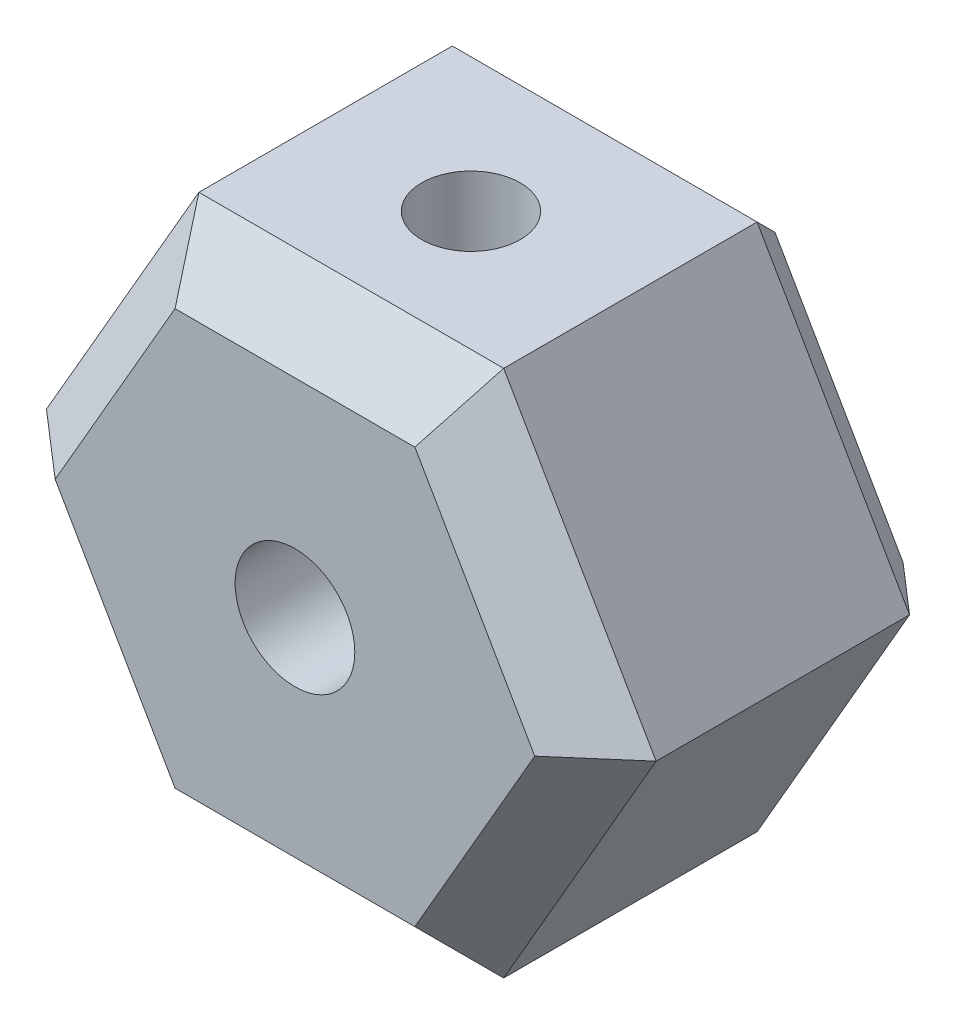
ISO-10303-21;
HEADER;
FILE_DESCRIPTION(('STEP AP214'),'2;1');
FILE_NAME('part.step','',(''),(''),'','','');
FILE_SCHEMA(('AUTOMOTIVE_DESIGN { 1 0 10303 214 1 1 1 1 }'));
ENDSEC;
DATA;
#1=APPLICATION_CONTEXT('core data for automotive mechanical design processes');
#2=APPLICATION_PROTOCOL_DEFINITION('international standard','automotive_design',2000,#1);
#3=PRODUCT_CONTEXT('',#1,'mechanical');
#4=PRODUCT('Part','Part','',(#3));
#5=PRODUCT_RELATED_PRODUCT_CATEGORY('part','',(#4));
#6=PRODUCT_DEFINITION_FORMATION('','',#4);
#7=PRODUCT_DEFINITION_CONTEXT('part definition',#1,'design');
#8=PRODUCT_DEFINITION('design','',#6,#7);
#9=PRODUCT_DEFINITION_SHAPE('','',#8);
#10=(LENGTH_UNIT() NAMED_UNIT(*) SI_UNIT(.MILLI.,.METRE.));
#11=(NAMED_UNIT(*) PLANE_ANGLE_UNIT() SI_UNIT($,.RADIAN.));
#12=(NAMED_UNIT(*) SI_UNIT($,.STERADIAN.) SOLID_ANGLE_UNIT());
#13=UNCERTAINTY_MEASURE_WITH_UNIT(LENGTH_MEASURE(1.E-05),#10,'distance_accuracy_value','');
#14=(GEOMETRIC_REPRESENTATION_CONTEXT(3) GLOBAL_UNCERTAINTY_ASSIGNED_CONTEXT((#13)) GLOBAL_UNIT_ASSIGNED_CONTEXT((#10,
#11,#12)) REPRESENTATION_CONTEXT('',''));
#15=CARTESIAN_POINT('',(0.,0.,0.));
#16=DIRECTION('',(0.,0.,1.));
#17=DIRECTION('',(1.,0.,0.));
#18=AXIS2_PLACEMENT_3D('',#15,#16,#17);
#19=CARTESIAN_POINT('',(0.,0.,10.));
#20=DIRECTION('',(0.,0.,1.));
#21=DIRECTION('',(1.,0.,0.));
#22=AXIS2_PLACEMENT_3D('',#19,#20,#21);
#23=PLANE('',#22);
#24=DIRECTION('',(-0.5,-0.866025403784439,0.));
#25=VECTOR('',#24,1.);
#26=CARTESIAN_POINT('',(-7.27461339178929,-0.8,10.));
#27=LINE('',#26,#25);
#28=CARTESIAN_POINT('',(-3.40636658821879,5.90000000000001,10.));
#29=VERTEX_POINT('',#28);
#30=CARTESIAN_POINT('',(-6.81273317643759,0.,10.));
#31=VERTEX_POINT('',#30);
#32=EDGE_CURVE('E138',#29,#31,#27,.T.);
#33=ORIENTED_EDGE('',*,*,#32,.T.);
#34=DIRECTION('',(0.5,-0.866025403784439,0.));
#35=VECTOR('',#34,1.);
#36=CARTESIAN_POINT('',(-2.94448637286709,-6.7,10.));
#37=LINE('',#36,#35);
#38=CARTESIAN_POINT('',(-3.40636658821879,-5.90000000000001,10.));
#39=VERTEX_POINT('',#38);
#40=EDGE_CURVE('E185',#31,#39,#37,.T.);
#41=ORIENTED_EDGE('',*,*,#40,.T.);
#42=DIRECTION('',(1.,0.,0.));
#43=VECTOR('',#42,1.);
#44=CARTESIAN_POINT('',(4.33012701892219,-5.90000000000001,10.));
#45=LINE('',#44,#43);
#46=CARTESIAN_POINT('',(3.40636658821879,-5.90000000000001,10.));
#47=VERTEX_POINT('',#46);
#48=EDGE_CURVE('E182',#39,#47,#45,.T.);
#49=ORIENTED_EDGE('',*,*,#48,.T.);
#50=DIRECTION('',(0.5,0.866025403784439,0.));
#51=VECTOR('',#50,1.);
#52=CARTESIAN_POINT('',(7.27461339178929,0.800000000000001,10.));
#53=LINE('',#52,#51);
#54=CARTESIAN_POINT('',(6.81273317643758,0.,10.));
#55=VERTEX_POINT('',#54);
#56=EDGE_CURVE('E179',#47,#55,#53,.T.);
#57=ORIENTED_EDGE('',*,*,#56,.T.);
#58=DIRECTION('',(-0.5,0.866025403784439,0.));
#59=VECTOR('',#58,1.);
#60=CARTESIAN_POINT('',(2.94448637286709,6.70000000000001,10.));
#61=LINE('',#60,#59);
#62=CARTESIAN_POINT('',(3.40636658821879,5.90000000000001,10.));
#63=VERTEX_POINT('',#62);
#64=EDGE_CURVE('E141',#55,#63,#61,.T.);
#65=ORIENTED_EDGE('',*,*,#64,.T.);
#66=DIRECTION('',(-1.,0.,0.));
#67=VECTOR('',#66,1.);
#68=CARTESIAN_POINT('',(-4.33012701892219,5.90000000000001,10.));
#69=LINE('',#68,#67);
#70=EDGE_CURVE('E133',#63,#29,#69,.T.);
#71=ORIENTED_EDGE('',*,*,#70,.T.);
#72=EDGE_LOOP('',(#33,#41,#49,#57,#65,#71));
#73=FACE_BOUND('',#72,.T.);
#74=CARTESIAN_POINT('',(0.,0.,10.));
#75=DIRECTION('',(0.,0.,1.));
#76=DIRECTION('',(1.,0.,0.));
#77=AXIS2_PLACEMENT_3D('',#74,#75,#76);
#78=CIRCLE('',#77,1.7);
#79=CARTESIAN_POINT('',(1.7,0.,10.));
#80=VERTEX_POINT('',#79);
#81=EDGE_CURVE('E576',#80,#80,#78,.T.);
#82=ORIENTED_EDGE('',*,*,#81,.F.);
#83=EDGE_LOOP('',(#82));
#84=FACE_BOUND('',#83,.T.);
#85=ADVANCED_FACE('F41',(#73,#84),#23,.T.);
#86=CARTESIAN_POINT('',(0.,0.,0.));
#87=DIRECTION('',(0.,0.,1.));
#88=DIRECTION('',(1.,0.,0.));
#89=AXIS2_PLACEMENT_3D('',#86,#87,#88);
#90=PLANE('',#89);
#91=DIRECTION('',(0.5,0.866025403784439,0.));
#92=VECTOR('',#91,1.);
#93=CARTESIAN_POINT('',(-5.45596004384196,3.15,0.));
#94=LINE('',#93,#92);
#95=CARTESIAN_POINT('',(-7.27461339178929,0.,0.));
#96=VERTEX_POINT('',#95);
#97=CARTESIAN_POINT('',(-3.63730669589464,6.3,0.));
#98=VERTEX_POINT('',#97);
#99=EDGE_CURVE('E225',#96,#98,#94,.T.);
#100=ORIENTED_EDGE('',*,*,#99,.T.);
#101=DIRECTION('',(1.,0.,0.));
#102=VECTOR('',#101,1.);
#103=CARTESIAN_POINT('',(0.,6.3,0.));
#104=LINE('',#103,#102);
#105=CARTESIAN_POINT('',(3.63730669589464,6.3,0.));
#106=VERTEX_POINT('',#105);
#107=EDGE_CURVE('E240',#98,#106,#104,.T.);
#108=ORIENTED_EDGE('',*,*,#107,.T.);
#109=DIRECTION('',(0.5,-0.866025403784439,0.));
#110=VECTOR('',#109,1.);
#111=CARTESIAN_POINT('',(5.45596004384196,3.15,0.));
#112=LINE('',#111,#110);
#113=CARTESIAN_POINT('',(7.27461339178928,0.,0.));
#114=VERTEX_POINT('',#113);
#115=EDGE_CURVE('E237',#106,#114,#112,.T.);
#116=ORIENTED_EDGE('',*,*,#115,.T.);
#117=DIRECTION('',(-0.5,-0.866025403784439,0.));
#118=VECTOR('',#117,1.);
#119=CARTESIAN_POINT('',(5.45596004384196,-3.15,0.));
#120=LINE('',#119,#118);
#121=CARTESIAN_POINT('',(3.63730669589464,-6.3,0.));
#122=VERTEX_POINT('',#121);
#123=EDGE_CURVE('E234',#114,#122,#120,.T.);
#124=ORIENTED_EDGE('',*,*,#123,.T.);
#125=DIRECTION('',(-1.,0.,0.));
#126=VECTOR('',#125,1.);
#127=CARTESIAN_POINT('',(0.,-6.3,0.));
#128=LINE('',#127,#126);
#129=CARTESIAN_POINT('',(-3.63730669589464,-6.3,0.));
#130=VERTEX_POINT('',#129);
#131=EDGE_CURVE('E231',#122,#130,#128,.T.);
#132=ORIENTED_EDGE('',*,*,#131,.T.);
#133=DIRECTION('',(-0.5,0.866025403784439,0.));
#134=VECTOR('',#133,1.);
#135=CARTESIAN_POINT('',(-5.45596004384197,-3.15,0.));
#136=LINE('',#135,#134);
#137=EDGE_CURVE('E228',#130,#96,#136,.T.);
#138=ORIENTED_EDGE('',*,*,#137,.T.);
#139=EDGE_LOOP('',(#100,#108,#116,#124,#132,#138));
#140=FACE_BOUND('',#139,.T.);
#141=CARTESIAN_POINT('',(0.,0.,0.));
#142=DIRECTION('',(0.,0.,1.));
#143=DIRECTION('',(1.,0.,0.));
#144=AXIS2_PLACEMENT_3D('',#141,#142,#143);
#145=CIRCLE('',#144,1.7);
#146=CARTESIAN_POINT('',(1.7,0.,0.));
#147=VERTEX_POINT('',#146);
#148=EDGE_CURVE('E582',#147,#147,#145,.T.);
#149=ORIENTED_EDGE('',*,*,#148,.T.);
#150=EDGE_LOOP('',(#149));
#151=FACE_BOUND('',#150,.T.);
#152=ADVANCED_FACE('F286',(#140,#151),#90,.F.);
#153=CARTESIAN_POINT('',(4.33012701892219,-7.5,10.));
#154=DIRECTION('',(-0.866025403784439,0.5,0.));
#155=DIRECTION('',(-0.5,-0.866025403784439,0.));
#156=AXIS2_PLACEMENT_3D('',#153,#154,#155);
#157=PLANE('',#156);
#158=DIRECTION('',(0.,0.,-1.));
#159=VECTOR('',#158,1.);
#160=CARTESIAN_POINT('',(4.33012701892219,-7.5,10.));
#161=LINE('',#160,#159);
#162=CARTESIAN_POINT('',(4.33012701892219,-7.5,8.4));
#163=VERTEX_POINT('',#162);
#164=CARTESIAN_POINT('',(4.33012701892219,-7.5,1.19999999999999));
#165=VERTEX_POINT('',#164);
#166=EDGE_CURVE('E572',#163,#165,#161,.T.);
#167=ORIENTED_EDGE('',*,*,#166,.T.);
#168=DIRECTION('',(0.5,0.866025403784439,0.));
#169=VECTOR('',#168,1.);
#170=CARTESIAN_POINT('',(4.33012701892219,-7.5,1.19999999999999));
#171=LINE('',#170,#169);
#172=CARTESIAN_POINT('',(8.66025403784438,0.,1.19999999999999));
#173=VERTEX_POINT('',#172);
#174=EDGE_CURVE('E247',#165,#173,#171,.T.);
#175=ORIENTED_EDGE('',*,*,#174,.T.);
#176=DIRECTION('',(0.,0.,-1.));
#177=VECTOR('',#176,1.);
#178=CARTESIAN_POINT('',(8.66025403784438,0.,10.));
#179=LINE('',#178,#177);
#180=CARTESIAN_POINT('',(8.66025403784438,0.,8.4));
#181=VERTEX_POINT('',#180);
#182=EDGE_CURVE('E162',#181,#173,#179,.T.);
#183=ORIENTED_EDGE('',*,*,#182,.F.);
#184=DIRECTION('',(-0.5,-0.866025403784439,0.));
#185=VECTOR('',#184,1.);
#186=CARTESIAN_POINT('',(4.33012701892219,-7.5,8.4));
#187=LINE('',#186,#185);
#188=EDGE_CURVE('E195',#181,#163,#187,.T.);
#189=ORIENTED_EDGE('',*,*,#188,.T.);
#190=EDGE_LOOP('',(#167,#175,#183,#189));
#191=FACE_BOUND('',#190,.T.);
#192=ADVANCED_FACE('F341',(#191),#157,.F.);
#193=CARTESIAN_POINT('',(8.66025403784438,0.,10.));
#194=DIRECTION('',(-0.866025403784439,-0.5,0.));
#195=DIRECTION('',(0.5,-0.866025403784439,0.));
#196=AXIS2_PLACEMENT_3D('',#193,#194,#195);
#197=PLANE('',#196);
#198=ORIENTED_EDGE('',*,*,#182,.T.);
#199=DIRECTION('',(-0.5,0.866025403784439,0.));
#200=VECTOR('',#199,1.);
#201=CARTESIAN_POINT('',(8.66025403784438,0.,1.19999999999999));
#202=LINE('',#201,#200);
#203=CARTESIAN_POINT('',(4.33012701892219,7.5,1.19999999999999));
#204=VERTEX_POINT('',#203);
#205=EDGE_CURVE('E244',#173,#204,#202,.T.);
#206=ORIENTED_EDGE('',*,*,#205,.T.);
#207=DIRECTION('',(0.,0.,-1.));
#208=VECTOR('',#207,1.);
#209=CARTESIAN_POINT('',(4.33012701892219,7.5,10.));
#210=LINE('',#209,#208);
#211=CARTESIAN_POINT('',(4.33012701892219,7.5,8.4));
#212=VERTEX_POINT('',#211);
#213=EDGE_CURVE('E166',#212,#204,#210,.T.);
#214=ORIENTED_EDGE('',*,*,#213,.F.);
#215=DIRECTION('',(0.5,-0.866025403784439,0.));
#216=VECTOR('',#215,1.);
#217=CARTESIAN_POINT('',(8.66025403784438,0.,8.4));
#218=LINE('',#217,#216);
#219=EDGE_CURVE('E198',#212,#181,#218,.T.);
#220=ORIENTED_EDGE('',*,*,#219,.T.);
#221=EDGE_LOOP('',(#198,#206,#214,#220));
#222=FACE_BOUND('',#221,.T.);
#223=ADVANCED_FACE('F299',(#222),#197,.F.);
#224=CARTESIAN_POINT('',(4.33012701892219,7.5,10.));
#225=DIRECTION('',(0.,-1.,0.));
#226=DIRECTION('',(0.,0.,-1.));
#227=AXIS2_PLACEMENT_3D('',#224,#225,#226);
#228=PLANE('',#227);
#229=CARTESIAN_POINT('',(0.,7.50000000000001,5.));
#230=DIRECTION('',(0.,-1.,0.));
#231=DIRECTION('',(0.,0.,-1.));
#232=AXIS2_PLACEMENT_3D('',#229,#230,#231);
#233=CIRCLE('',#232,1.4);
#234=CARTESIAN_POINT('',(0.,7.50000000000001,3.6));
#235=VERTEX_POINT('',#234);
#236=EDGE_CURVE('E318',#235,#235,#233,.T.);
#237=ORIENTED_EDGE('',*,*,#236,.T.);
#238=EDGE_LOOP('',(#237));
#239=FACE_BOUND('',#238,.T.);
#240=ORIENTED_EDGE('',*,*,#213,.T.);
#241=DIRECTION('',(-1.,0.,0.));
#242=VECTOR('',#241,1.);
#243=CARTESIAN_POINT('',(4.33012701892219,7.5,1.19999999999999));
#244=LINE('',#243,#242);
#245=CARTESIAN_POINT('',(-4.33012701892219,7.5,1.19999999999999));
#246=VERTEX_POINT('',#245);
#247=EDGE_CURVE('E206',#204,#246,#244,.T.);
#248=ORIENTED_EDGE('',*,*,#247,.T.);
#249=DIRECTION('',(0.,0.,-1.));
#250=VECTOR('',#249,1.);
#251=CARTESIAN_POINT('',(-4.33012701892219,7.5,10.));
#252=LINE('',#251,#250);
#253=CARTESIAN_POINT('',(-4.33012701892219,7.5,8.4));
#254=VERTEX_POINT('',#253);
#255=EDGE_CURVE('E306',#254,#246,#252,.T.);
#256=ORIENTED_EDGE('',*,*,#255,.F.);
#257=DIRECTION('',(1.,0.,0.));
#258=VECTOR('',#257,1.);
#259=CARTESIAN_POINT('',(4.33012701892219,7.5,8.4));
#260=LINE('',#259,#258);
#261=EDGE_CURVE('E151',#254,#212,#260,.T.);
#262=ORIENTED_EDGE('',*,*,#261,.T.);
#263=EDGE_LOOP('',(#240,#248,#256,#262));
#264=FACE_BOUND('',#263,.T.);
#265=ADVANCED_FACE('F303',(#239,#264),#228,.F.);
#266=CARTESIAN_POINT('',(-4.33012701892219,7.5,10.));
#267=DIRECTION('',(0.866025403784439,-0.5,0.));
#268=DIRECTION('',(0.5,0.866025403784439,0.));
#269=AXIS2_PLACEMENT_3D('',#266,#267,#268);
#270=PLANE('',#269);
#271=ORIENTED_EDGE('',*,*,#255,.T.);
#272=DIRECTION('',(-0.5,-0.866025403784439,0.));
#273=VECTOR('',#272,1.);
#274=CARTESIAN_POINT('',(-4.33012701892219,7.5,1.19999999999999));
#275=LINE('',#274,#273);
#276=CARTESIAN_POINT('',(-8.66025403784439,0.,1.19999999999999));
#277=VERTEX_POINT('',#276);
#278=EDGE_CURVE('E11',#246,#277,#275,.T.);
#279=ORIENTED_EDGE('',*,*,#278,.T.);
#280=DIRECTION('',(0.,0.,-1.));
#281=VECTOR('',#280,1.);
#282=CARTESIAN_POINT('',(-8.66025403784439,0.,10.));
#283=LINE('',#282,#281);
#284=CARTESIAN_POINT('',(-8.66025403784439,0.,8.4));
#285=VERTEX_POINT('',#284);
#286=EDGE_CURVE('E309',#285,#277,#283,.T.);
#287=ORIENTED_EDGE('',*,*,#286,.F.);
#288=DIRECTION('',(0.5,0.866025403784439,0.));
#289=VECTOR('',#288,1.);
#290=CARTESIAN_POINT('',(-4.33012701892219,7.5,8.4));
#291=LINE('',#290,#289);
#292=EDGE_CURVE('E203',#285,#254,#291,.T.);
#293=ORIENTED_EDGE('',*,*,#292,.T.);
#294=EDGE_LOOP('',(#271,#279,#287,#293));
#295=FACE_BOUND('',#294,.T.);
#296=ADVANCED_FACE('F350',(#295),#270,.F.);
#297=CARTESIAN_POINT('',(-8.66025403784439,0.,10.));
#298=DIRECTION('',(0.866025403784439,0.5,0.));
#299=DIRECTION('',(-0.5,0.866025403784439,0.));
#300=AXIS2_PLACEMENT_3D('',#297,#298,#299);
#301=PLANE('',#300);
#302=ORIENTED_EDGE('',*,*,#286,.T.);
#303=DIRECTION('',(0.5,-0.866025403784439,0.));
#304=VECTOR('',#303,1.);
#305=CARTESIAN_POINT('',(-8.66025403784439,0.,1.19999999999999));
#306=LINE('',#305,#304);
#307=CARTESIAN_POINT('',(-4.33012701892219,-7.5,1.19999999999999));
#308=VERTEX_POINT('',#307);
#309=EDGE_CURVE('E52',#277,#308,#306,.T.);
#310=ORIENTED_EDGE('',*,*,#309,.T.);
#311=DIRECTION('',(0.,0.,-1.));
#312=VECTOR('',#311,1.);
#313=CARTESIAN_POINT('',(-4.33012701892219,-7.5,10.));
#314=LINE('',#313,#312);
#315=CARTESIAN_POINT('',(-4.33012701892219,-7.5,8.4));
#316=VERTEX_POINT('',#315);
#317=EDGE_CURVE('E575',#316,#308,#314,.T.);
#318=ORIENTED_EDGE('',*,*,#317,.F.);
#319=DIRECTION('',(-0.5,0.866025403784439,0.));
#320=VECTOR('',#319,1.);
#321=CARTESIAN_POINT('',(-8.66025403784439,0.,8.4));
#322=LINE('',#321,#320);
#323=EDGE_CURVE('E188',#316,#285,#322,.T.);
#324=ORIENTED_EDGE('',*,*,#323,.T.);
#325=EDGE_LOOP('',(#302,#310,#318,#324));
#326=FACE_BOUND('',#325,.T.);
#327=ADVANCED_FACE('F346',(#326),#301,.F.);
#328=CARTESIAN_POINT('',(-4.33012701892219,-7.5,10.));
#329=DIRECTION('',(0.,1.,0.));
#330=DIRECTION('',(0.,0.,1.));
#331=AXIS2_PLACEMENT_3D('',#328,#329,#330);
#332=PLANE('',#331);
#333=CARTESIAN_POINT('',(0.,-7.5,5.));
#334=DIRECTION('',(0.,-1.,0.));
#335=DIRECTION('',(0.,0.,-1.));
#336=AXIS2_PLACEMENT_3D('',#333,#334,#335);
#337=CIRCLE('',#336,1.4);
#338=CARTESIAN_POINT('',(0.,-7.5,3.6));
#339=VERTEX_POINT('',#338);
#340=EDGE_CURVE('E221',#339,#339,#337,.T.);
#341=ORIENTED_EDGE('',*,*,#340,.F.);
#342=EDGE_LOOP('',(#341));
#343=FACE_BOUND('',#342,.T.);
#344=ORIENTED_EDGE('',*,*,#317,.T.);
#345=DIRECTION('',(1.,0.,0.));
#346=VECTOR('',#345,1.);
#347=CARTESIAN_POINT('',(-4.33012701892219,-7.5,1.19999999999999));
#348=LINE('',#347,#346);
#349=EDGE_CURVE('E250',#308,#165,#348,.T.);
#350=ORIENTED_EDGE('',*,*,#349,.T.);
#351=ORIENTED_EDGE('',*,*,#166,.F.);
#352=DIRECTION('',(-1.,0.,0.));
#353=VECTOR('',#352,1.);
#354=CARTESIAN_POINT('',(-4.33012701892219,-7.5,8.4));
#355=LINE('',#354,#353);
#356=EDGE_CURVE('E192',#163,#316,#355,.T.);
#357=ORIENTED_EDGE('',*,*,#356,.T.);
#358=EDGE_LOOP('',(#344,#350,#351,#357));
#359=FACE_BOUND('',#358,.T.);
#360=ADVANCED_FACE('F334',(#343,#359),#332,.F.);
#361=CARTESIAN_POINT('',(0.,0.,10.));
#362=DIRECTION('',(0.,0.,-1.));
#363=DIRECTION('',(-1.,0.,0.));
#364=AXIS2_PLACEMENT_3D('',#361,#362,#363);
#365=CYLINDRICAL_SURFACE('',#364,1.7);
#366=CARTESIAN_POINT('',(0.,1.7,3.6));
#367=CARTESIAN_POINT('',(0.0666820223288311,1.69999449142912,3.60000564747561));
#368=CARTESIAN_POINT('',(0.133430657033193,1.69603833078622,3.60480241454595));
#369=CARTESIAN_POINT('',(0.264743941965022,1.6805660355787,3.62365342349991));
#370=CARTESIAN_POINT('',(0.329304963145682,1.66903792920128,3.63772232544222));
#371=CARTESIAN_POINT('',(0.454004911980761,1.63950038484113,3.67407645847399));
#372=CARTESIAN_POINT('',(0.514168782047513,1.62153158734844,3.69631019092876));
#373=CARTESIAN_POINT('',(0.62939974683946,1.58038206278026,3.74786293267664));
#374=CARTESIAN_POINT('',(0.684465984913349,1.55720046193544,3.77718312986363));
#375=CARTESIAN_POINT('',(0.807902945775991,1.49784004555909,3.85356984487395));
#376=CARTESIAN_POINT('',(0.87387357689181,1.4599940786638,3.90321826666244));
#377=CARTESIAN_POINT('',(0.995044522962697,1.38027795343869,4.0118008526498));
#378=CARTESIAN_POINT('',(1.05021339664605,1.33839656182778,4.07076124754224));
#379=CARTESIAN_POINT('',(1.15044843684771,1.25333809351418,4.19802819528564));
#380=CARTESIAN_POINT('',(1.19531863167952,1.21015120219439,4.26648162509186));
#381=CARTESIAN_POINT('',(1.27321058732181,1.1278744036947,4.41201787272045));
#382=CARTESIAN_POINT('',(1.30626875525627,1.08877217508942,4.48907319694093));
#383=CARTESIAN_POINT('',(1.34717309423091,1.03715682984792,4.61609600172038));
#384=CARTESIAN_POINT('',(1.35969335978017,1.02055263051793,4.6628695467615));
#385=CARTESIAN_POINT('',(1.37997140442047,0.992960960472711,4.75899810270167));
#386=CARTESIAN_POINT('',(1.38774100740388,0.981959556506767,4.80834637004067));
#387=CARTESIAN_POINT('',(1.39798642795757,0.967328228678957,4.9093014724519));
#388=CARTESIAN_POINT('',(1.40040269199708,0.963781254154626,4.96092726232001));
#389=CARTESIAN_POINT('',(1.39948613222214,0.965110285334181,5.06402416576586));
#390=CARTESIAN_POINT('',(1.39615139580212,0.96998909319444,5.11549522218098));
#391=CARTESIAN_POINT('',(1.38344862143212,0.988026045981723,5.22192970277297));
#392=CARTESIAN_POINT('',(1.37346765705515,1.0020217605587,5.27666961947555));
#393=CARTESIAN_POINT('',(1.3477723547452,1.0363238386596,5.3827641479117));
#394=CARTESIAN_POINT('',(1.33203964019991,1.05665039780869,5.43410727910985));
#395=CARTESIAN_POINT('',(1.2853097290658,1.11354025356566,5.56106801127117));
#396=CARTESIAN_POINT('',(1.25070230602668,1.15281041027264,5.6341207317812));
#397=CARTESIAN_POINT('',(1.17052287959237,1.23416858137829,5.77217532683925));
#398=CARTESIAN_POINT('',(1.12493227696365,1.2762612873588,5.83716325832773));
#399=CARTESIAN_POINT('',(1.02081910112618,1.361116119848,5.96165921764711));
#400=CARTESIAN_POINT('',(0.961822211049634,1.40382836608332,6.02080831833226));
#401=CARTESIAN_POINT('',(0.832294090781348,1.48427599067882,6.12887696900596));
#402=CARTESIAN_POINT('',(0.76179072274762,1.52202300284762,6.1778205944737));
#403=CARTESIAN_POINT('',(0.6299097419922,1.58017666345559,6.25193150426584));
#404=CARTESIAN_POINT('',(0.571006995210644,1.60253305795588,6.27996670473242));
#405=CARTESIAN_POINT('',(0.448103521512919,1.64113982469312,6.32798532087161));
#406=CARTESIAN_POINT('',(0.384106337572288,1.65739439630456,6.34797427479052));
#407=CARTESIAN_POINT('',(0.252034114338511,1.6825645048275,6.37880504674161));
#408=CARTESIAN_POINT('',(0.183934349751986,1.69142949047275,6.38958387175133));
#409=CARTESIAN_POINT('',(0.0463224196403452,1.70076475945023,6.40093253710515));
#410=CARTESIAN_POINT('',(-0.0231890451669425,1.70123911033883,6.40150732409573));
#411=CARTESIAN_POINT('',(-0.153637465246659,1.69416729776591,6.39291302692997));
#412=CARTESIAN_POINT('',(-0.21469478108814,1.68747549756979,6.38478189897832));
#413=CARTESIAN_POINT('',(-0.33425364144051,1.66791652573572,6.36087933831486));
#414=CARTESIAN_POINT('',(-0.392754760786029,1.6550483310281,6.34510663983479));
#415=CARTESIAN_POINT('',(-0.507648192552237,1.62356079136674,6.30617190346097));
#416=CARTESIAN_POINT('',(-0.563925415442198,1.604781226347,6.28280332939315));
#417=CARTESIAN_POINT('',(-0.671637622920038,1.56277050687445,6.22984148865462));
#418=CARTESIAN_POINT('',(-0.723071081951937,1.53953795688882,6.20024627031448));
#419=CARTESIAN_POINT('',(-0.842813037837287,1.47851050074173,6.12111325492451));
#420=CARTESIAN_POINT('',(-0.908234145856306,1.43888140119219,6.06860940867473));
#421=CARTESIAN_POINT('',(-1.02786654295186,1.35602722672107,5.95413978965658));
#422=CARTESIAN_POINT('',(-1.08203548727503,1.31278939689305,5.89213974763653));
#423=CARTESIAN_POINT('',(-1.17971361489082,1.22581096496119,5.75846431017866));
#424=CARTESIAN_POINT('',(-1.22302183261264,1.18207463247783,5.68663988323566));
#425=CARTESIAN_POINT('',(-1.29698028453727,1.1003779320948,5.53384758966914));
#426=CARTESIAN_POINT('',(-1.32769045241657,1.06239077148853,5.45292540550793));
#427=CARTESIAN_POINT('',(-1.36317930319777,1.01595479032419,5.32233182848918));
#428=CARTESIAN_POINT('',(-1.37334432968565,1.00205040286977,5.27610419510741));
#429=CARTESIAN_POINT('',(-1.38900323419096,0.980230084742059,5.18153756334061));
#430=CARTESIAN_POINT('',(-1.39450929390184,0.972298543025567,5.1332044207142));
#431=CARTESIAN_POINT('',(-1.40042369195171,0.963766977456807,5.03516911016342));
#432=CARTESIAN_POINT('',(-1.40079272170448,0.9632234877663,4.985459299134));
#433=CARTESIAN_POINT('',(-1.39628993700919,0.969735019220994,4.88675721462697));
#434=CARTESIAN_POINT('',(-1.39141131781837,0.976799906331338,4.8377659565075));
#435=CARTESIAN_POINT('',(-1.37521777285861,0.999501821691919,4.73108979485434));
#436=CARTESIAN_POINT('',(-1.36269892234573,1.0167134004647,4.673937644131));
#437=CARTESIAN_POINT('',(-1.33148924176057,1.05725625442954,4.563599081805));
#438=CARTESIAN_POINT('',(-1.31277885009583,1.08060687667215,4.51042590275966));
#439=CARTESIAN_POINT('',(-1.25818393478977,1.14435613176708,4.38003267785408));
#440=CARTESIAN_POINT('',(-1.21850255551409,1.18709569243611,4.30555931934911));
#441=CARTESIAN_POINT('',(-1.12714941432471,1.27418790358212,4.16541588646235));
#442=CARTESIAN_POINT('',(-1.07545999034243,1.31854284821849,4.09975900651507));
#443=CARTESIAN_POINT('',(-0.958657438393328,1.40585991501626,3.97608633504554));
#444=CARTESIAN_POINT('',(-0.893221085023852,1.44875264107422,3.91832310636414));
#445=CARTESIAN_POINT('',(-0.750088111282246,1.52774447778181,3.81462260194069));
#446=CARTESIAN_POINT('',(-0.672427631575991,1.56386294760665,3.76865148438619));
#447=CARTESIAN_POINT('',(-0.532549488419312,1.61557144771124,3.70372856000956));
#448=CARTESIAN_POINT('',(-0.473216748012853,1.63404113379092,3.68082975061776));
#449=CARTESIAN_POINT('',(-0.350541563476338,1.66465896678609,3.64308685345148));
#450=CARTESIAN_POINT('',(-0.2872082839488,1.6768210136238,3.62822505169092));
#451=CARTESIAN_POINT('',(-0.186119399225928,1.69018656079218,3.61192917040336));
#452=CARTESIAN_POINT('',(-0.149144169074543,1.69385458280605,3.60746767588503));
#453=CARTESIAN_POINT('',(-0.0747863464007902,1.69876315644556,3.60150113033692));
#454=CARTESIAN_POINT('',(-0.0374036525765536,1.70000308989836,3.59999683218642));
#455=CARTESIAN_POINT('',(0.,1.7,3.6));
#456=B_SPLINE_CURVE_WITH_KNOTS('',3,(#366,#367,#368,#369,#370,#371,#372,#373,#374,#375,#376,
#377,#378,#379,#380,#381,#382,#383,#384,#385,#386,#387,#388,#389,#390,#391,#392,#393,#394,#395,
#396,#397,#398,#399,#400,#401,#402,#403,#404,#405,#406,#407,#408,#409,#410,#411,#412,#413,#414,
#415,#416,#417,#418,#419,#420,#421,#422,#423,#424,#425,#426,#427,#428,#429,#430,#431,#432,#433,
#434,#435,#436,#437,#438,#439,#440,#441,#442,#443,#444,#445,#446,#447,#448,#449,#450,#451,#452,
#453,#454,#455),.UNSPECIFIED.,.T.,.F.,(4,2,2,2,2,2,2,2,2,2,2,2,2,2,2,2,2,2,2,2,2,2,2,2,2,2,2,2,
2,2,2,2,2,2,2,2,2,2,2,2,2,2,2,2,4),(0.,0.199884897267373,0.40008659072175,0.599046637955457,
0.798040059734968,1.06907071107025,1.34087890606626,1.617495173025,1.89325134311594,
2.04636819362193,2.19910238466644,2.35352732087915,2.50800362397179,2.6791699455718,
2.8508879854074,3.11906384426968,3.38769707224798,3.66795733233861,3.94754876447089,
4.15362473142472,4.35955861237084,4.56688996218744,4.77412080052902,4.95913609282839,
5.1441820419924,5.33475213569873,5.52538205061561,5.80222071849716,6.08008304571345,
6.36275991616768,6.64407593873309,6.79158321440915,6.9387036038095,7.0869491459076,
7.23538715328978,7.4173195421834,7.59983230646929,7.88212834481081,8.16484225785785,
8.45514871274336,8.74461246192013,8.94251977637802,9.13998909629272,9.25208111573698,
9.36420166924718),.UNSPECIFIED.);
#457=CARTESIAN_POINT('',(0.,1.7,3.6));
#458=VERTEX_POINT('',#457);
#459=EDGE_CURVE('E169',#458,#458,#456,.T.);
#460=ORIENTED_EDGE('',*,*,#459,.F.);
#461=EDGE_LOOP('',(#460));
#462=FACE_BOUND('',#461,.T.);
#463=CARTESIAN_POINT('',(0.,-1.7,3.6));
#464=CARTESIAN_POINT('',(-0.0666820223288363,-1.69999449142911,3.60000564747561));
#465=CARTESIAN_POINT('',(-0.133430657033198,-1.69603833078622,3.60480241454595));
#466=CARTESIAN_POINT('',(-0.264743941965028,-1.6805660355787,3.62365342349991));
#467=CARTESIAN_POINT('',(-0.329304963145688,-1.66903792920127,3.63772232544222));
#468=CARTESIAN_POINT('',(-0.454004911980767,-1.63950038484112,3.67407645847399));
#469=CARTESIAN_POINT('',(-0.514168782047518,-1.62153158734844,3.69631019092876));
#470=CARTESIAN_POINT('',(-0.629399746839465,-1.58038206278026,3.74786293267664));
#471=CARTESIAN_POINT('',(-0.684465984913355,-1.55720046193543,3.77718312986363));
#472=CARTESIAN_POINT('',(-0.807902945775997,-1.49784004555909,3.85356984487395));
#473=CARTESIAN_POINT('',(-0.873873576891815,-1.4599940786638,3.90321826666244));
#474=CARTESIAN_POINT('',(-0.995044522962703,-1.38027795343868,4.0118008526498));
#475=CARTESIAN_POINT('',(-1.05021339664606,-1.33839656182778,4.07076124754224));
#476=CARTESIAN_POINT('',(-1.15044843684772,-1.25333809351417,4.19802819528564));
#477=CARTESIAN_POINT('',(-1.19531863167952,-1.21015120219438,4.26648162509186));
#478=CARTESIAN_POINT('',(-1.27321058732182,-1.12787440369469,4.41201787272045));
#479=CARTESIAN_POINT('',(-1.30626875525627,-1.08877217508942,4.48907319694093));
#480=CARTESIAN_POINT('',(-1.34717309423091,-1.03715682984791,4.61609600172038));
#481=CARTESIAN_POINT('',(-1.35969335978017,-1.02055263051792,4.6628695467615));
#482=CARTESIAN_POINT('',(-1.37997140442048,-0.992960960472704,4.75899810270167));
#483=CARTESIAN_POINT('',(-1.38774100740389,-0.98195955650676,4.80834637004067));
#484=CARTESIAN_POINT('',(-1.39798642795757,-0.96732822867895,4.9093014724519));
#485=CARTESIAN_POINT('',(-1.40040269199709,-0.963781254154619,4.96092726232001));
#486=CARTESIAN_POINT('',(-1.39948613222214,-0.965110285334174,5.06402416576586));
#487=CARTESIAN_POINT('',(-1.39615139580212,-0.969989093194432,5.11549522218098));
#488=CARTESIAN_POINT('',(-1.38344862143212,-0.988026045981714,5.22192970277296));
#489=CARTESIAN_POINT('',(-1.37346765705516,-1.00202176055869,5.27666961947555));
#490=CARTESIAN_POINT('',(-1.3477723547452,-1.03632383865959,5.3827641479117));
#491=CARTESIAN_POINT('',(-1.33203964019992,-1.05665039780868,5.43410727910985));
#492=CARTESIAN_POINT('',(-1.28530972906581,-1.11354025356565,5.56106801127117));
#493=CARTESIAN_POINT('',(-1.25070230602669,-1.15281041027263,5.63412073178119));
#494=CARTESIAN_POINT('',(-1.17052287959238,-1.23416858137828,5.77217532683924));
#495=CARTESIAN_POINT('',(-1.12493227696366,-1.27626128735878,5.83716325832772));
#496=CARTESIAN_POINT('',(-1.02081910112619,-1.36111611984799,5.9616592176471));
#497=CARTESIAN_POINT('',(-0.961822211049648,-1.40382836608331,6.02080831833225));
#498=CARTESIAN_POINT('',(-0.832294090781364,-1.48427599067881,6.12887696900595));
#499=CARTESIAN_POINT('',(-0.761790722747637,-1.52202300284761,6.17782059447369));
#500=CARTESIAN_POINT('',(-0.629909741992218,-1.58017666345558,6.25193150426583));
#501=CARTESIAN_POINT('',(-0.571006995210662,-1.60253305795587,6.27996670473241));
#502=CARTESIAN_POINT('',(-0.448103521512937,-1.64113982469312,6.32798532087161));
#503=CARTESIAN_POINT('',(-0.384106337572306,-1.65739439630456,6.34797427479052));
#504=CARTESIAN_POINT('',(-0.252034114338529,-1.6825645048275,6.37880504674161));
#505=CARTESIAN_POINT('',(-0.183934349752004,-1.69142949047275,6.38958387175133));
#506=CARTESIAN_POINT('',(-0.0463224196403619,-1.70076475945023,6.40093253710515));
#507=CARTESIAN_POINT('',(0.0231890451669259,-1.70123911033883,6.40150732409573));
#508=CARTESIAN_POINT('',(0.153637465246643,-1.69416729776591,6.39291302692997));
#509=CARTESIAN_POINT('',(0.214694781088124,-1.6874754975698,6.38478189897832));
#510=CARTESIAN_POINT('',(0.334253641440495,-1.66791652573573,6.36087933831486));
#511=CARTESIAN_POINT('',(0.392754760786014,-1.6550483310281,6.34510663983479));
#512=CARTESIAN_POINT('',(0.507648192552223,-1.62356079136674,6.30617190346097));
#513=CARTESIAN_POINT('',(0.563925415442184,-1.60478122634701,6.28280332939316));
#514=CARTESIAN_POINT('',(0.671637622920024,-1.56277050687446,6.22984148865463));
#515=CARTESIAN_POINT('',(0.723071081951923,-1.53953795688882,6.20024627031448));
#516=CARTESIAN_POINT('',(0.842813037837274,-1.47851050074173,6.12111325492452));
#517=CARTESIAN_POINT('',(0.908234145856293,-1.4388814011922,6.06860940867474));
#518=CARTESIAN_POINT('',(1.02786654295184,-1.35602722672108,5.95413978965659));
#519=CARTESIAN_POINT('',(1.08203548727502,-1.31278939689306,5.89213974763654));
#520=CARTESIAN_POINT('',(1.1797136148908,-1.2258109649612,5.75846431017868));
#521=CARTESIAN_POINT('',(1.22302183261263,-1.18207463247785,5.68663988323567));
#522=CARTESIAN_POINT('',(1.29698028453726,-1.10037793209481,5.53384758966915));
#523=CARTESIAN_POINT('',(1.32769045241656,-1.06239077148855,5.45292540550795));
#524=CARTESIAN_POINT('',(1.36317930319776,-1.01595479032421,5.3223318284892));
#525=CARTESIAN_POINT('',(1.37334432968564,-1.00205040286978,5.27610419510742));
#526=CARTESIAN_POINT('',(1.38900323419095,-0.98023008474207,5.18153756334062));
#527=CARTESIAN_POINT('',(1.39450929390183,-0.972298543025577,5.13320442071422));
#528=CARTESIAN_POINT('',(1.4004236919517,-0.963766977456815,5.03516911016343));
#529=CARTESIAN_POINT('',(1.40079272170448,-0.963223487766308,4.98545929913402));
#530=CARTESIAN_POINT('',(1.39628993700919,-0.969735019221,4.88675721462699));
#531=CARTESIAN_POINT('',(1.39141131781837,-0.976799906331344,4.83776595650751));
#532=CARTESIAN_POINT('',(1.3752177728586,-0.999501821691925,4.73108979485434));
#533=CARTESIAN_POINT('',(1.36269892234572,-1.01671340046471,4.67393764413101));
#534=CARTESIAN_POINT('',(1.33148924176057,-1.05725625442954,4.56359908180501));
#535=CARTESIAN_POINT('',(1.31277885009583,-1.08060687667215,4.51042590275967));
#536=CARTESIAN_POINT('',(1.25818393478976,-1.14435613176708,4.38003267785408));
#537=CARTESIAN_POINT('',(1.21850255551409,-1.18709569243611,4.30555931934911));
#538=CARTESIAN_POINT('',(1.12714941432471,-1.27418790358212,4.16541588646236));
#539=CARTESIAN_POINT('',(1.07545999034243,-1.31854284821849,4.09975900651508));
#540=CARTESIAN_POINT('',(0.958657438393331,-1.40585991501626,3.97608633504555));
#541=CARTESIAN_POINT('',(0.893221085023857,-1.44875264107422,3.91832310636415));
#542=CARTESIAN_POINT('',(0.750088111282253,-1.52774447778181,3.81462260194069));
#543=CARTESIAN_POINT('',(0.672427631575998,-1.56386294760665,3.7686514843862));
#544=CARTESIAN_POINT('',(0.532549488419321,-1.61557144771124,3.70372856000956));
#545=CARTESIAN_POINT('',(0.473216748012863,-1.63404113379092,3.68082975061777));
#546=CARTESIAN_POINT('',(0.350541563476348,-1.66465896678609,3.64308685345148));
#547=CARTESIAN_POINT('',(0.287208283948809,-1.67682101362379,3.62822505169092));
#548=CARTESIAN_POINT('',(0.186119399225935,-1.69018656079218,3.61192917040336));
#549=CARTESIAN_POINT('',(0.149144169074548,-1.69385458280604,3.60746767588503));
#550=CARTESIAN_POINT('',(0.0747863464007905,-1.69876315644556,3.60150113033692));
#551=CARTESIAN_POINT('',(0.0374036525765511,-1.70000308989836,3.59999683218642));
#552=CARTESIAN_POINT('',(0.,-1.7,3.6));
#553=B_SPLINE_CURVE_WITH_KNOTS('',3,(#463,#464,#465,#466,#467,#468,#469,#470,#471,#472,#473,
#474,#475,#476,#477,#478,#479,#480,#481,#482,#483,#484,#485,#486,#487,#488,#489,#490,#491,#492,
#493,#494,#495,#496,#497,#498,#499,#500,#501,#502,#503,#504,#505,#506,#507,#508,#509,#510,#511,
#512,#513,#514,#515,#516,#517,#518,#519,#520,#521,#522,#523,#524,#525,#526,#527,#528,#529,#530,
#531,#532,#533,#534,#535,#536,#537,#538,#539,#540,#541,#542,#543,#544,#545,#546,#547,#548,#549,
#550,#551,#552),.UNSPECIFIED.,.T.,.F.,(4,2,2,2,2,2,2,2,2,2,2,2,2,2,2,2,2,2,2,2,2,2,2,2,2,2,2,2,
2,2,2,2,2,2,2,2,2,2,2,2,2,2,2,2,4),(0.,0.199884897267373,0.400086590721751,0.599046637955458,
0.798040059734969,1.06907071107025,1.34087890606626,1.617495173025,1.89325134311594,
2.04636819362193,2.19910238466644,2.35352732087915,2.50800362397179,2.6791699455718,
2.85088798540739,3.11906384426968,3.38769707224798,3.6679573323386,3.94754876447088,
4.15362473142471,4.35955861237083,4.56688996218743,4.77412080052901,4.95913609282839,
5.14418204199239,5.33475213569873,5.5253820506156,5.80222071849716,6.08008304571344,
6.36275991616767,6.64407593873307,6.79158321440913,6.93870360380949,7.08694914590759,
7.23538715328978,7.41731954218339,7.59983230646929,7.88212834481081,8.16484225785783,
8.45514871274335,8.74461246192012,8.942519776378,9.13998909629271,9.25208111573697,
9.36420166924718),.UNSPECIFIED.);
#554=CARTESIAN_POINT('',(0.,-1.7,3.6));
#555=VERTEX_POINT('',#554);
#556=EDGE_CURVE('E312',#555,#555,#553,.T.);
#557=ORIENTED_EDGE('',*,*,#556,.F.);
#558=EDGE_LOOP('',(#557));
#559=FACE_BOUND('',#558,.T.);
#560=ORIENTED_EDGE('',*,*,#81,.T.);
#561=EDGE_LOOP('',(#560));
#562=FACE_BOUND('',#561,.T.);
#563=ORIENTED_EDGE('',*,*,#148,.F.);
#564=EDGE_LOOP('',(#563));
#565=FACE_BOUND('',#564,.T.);
#566=ADVANCED_FACE('F319',(#462,#559,#562,#565),#365,.F.);
#567=CARTESIAN_POINT('',(0.,7.50000000000001,5.));
#568=DIRECTION('',(0.,-1.,0.));
#569=DIRECTION('',(0.,0.,-1.));
#570=AXIS2_PLACEMENT_3D('',#567,#568,#569);
#571=CYLINDRICAL_SURFACE('',#570,1.4);
#572=ORIENTED_EDGE('',*,*,#556,.T.);
#573=EDGE_LOOP('',(#572));
#574=FACE_BOUND('',#573,.T.);
#575=ORIENTED_EDGE('',*,*,#340,.T.);
#576=EDGE_LOOP('',(#575));
#577=FACE_BOUND('',#576,.T.);
#578=ADVANCED_FACE('F322',(#574,#577),#571,.F.);
#579=ORIENTED_EDGE('',*,*,#459,.T.);
#580=EDGE_LOOP('',(#579));
#581=FACE_BOUND('',#580,.T.);
#582=ORIENTED_EDGE('',*,*,#236,.F.);
#583=EDGE_LOOP('',(#582));
#584=FACE_BOUND('',#583,.T.);
#585=ADVANCED_FACE('F325',(#581,#584),#571,.F.);
#586=CARTESIAN_POINT('',(5.10954988232819,2.95,10.));
#587=DIRECTION('',(0.612372435695796,0.353553390593275,0.707106781186546));
#588=DIRECTION('',(0.5,-0.866025403784439,0.));
#589=AXIS2_PLACEMENT_3D('',#586,#587,#588);
#590=PLANE('',#589);
#591=DIRECTION('',(0.755928946018453,0.,-0.654653670707979));
#592=VECTOR('',#591,1.);
#593=CARTESIAN_POINT('',(5.83948557980365,0.,10.8428571428571));
#594=LINE('',#593,#592);
#595=EDGE_CURVE('E155',#181,#55,#594,.F.);
#596=ORIENTED_EDGE('',*,*,#595,.F.);
#597=ORIENTED_EDGE('',*,*,#219,.F.);
#598=DIRECTION('',(0.377964473009227,0.654653670707976,-0.654653670707979));
#599=VECTOR('',#598,1.);
#600=CARTESIAN_POINT('',(2.91974278990182,5.05714285714287,10.8428571428571));
#601=LINE('',#600,#599);
#602=EDGE_CURVE('E218',#63,#212,#601,.T.);
#603=ORIENTED_EDGE('',*,*,#602,.F.);
#604=ORIENTED_EDGE('',*,*,#64,.F.);
#605=EDGE_LOOP('',(#596,#597,#603,#604));
#606=FACE_BOUND('',#605,.T.);
#607=ADVANCED_FACE('F332',(#606),#590,.T.);
#608=CARTESIAN_POINT('',(0.,5.90000000000001,10.));
#609=DIRECTION('',(0.,0.707106781186549,0.707106781186546));
#610=DIRECTION('',(1.,0.,0.));
#611=AXIS2_PLACEMENT_3D('',#608,#609,#610);
#612=PLANE('',#611);
#613=ORIENTED_EDGE('',*,*,#602,.T.);
#614=ORIENTED_EDGE('',*,*,#261,.F.);
#615=DIRECTION('',(-0.377964473009227,0.654653670707976,-0.654653670707979));
#616=VECTOR('',#615,1.);
#617=CARTESIAN_POINT('',(-2.91974278990182,5.05714285714287,10.8428571428571));
#618=LINE('',#617,#616);
#619=EDGE_CURVE('E149',#29,#254,#618,.T.);
#620=ORIENTED_EDGE('',*,*,#619,.F.);
#621=ORIENTED_EDGE('',*,*,#70,.F.);
#622=EDGE_LOOP('',(#613,#614,#620,#621));
#623=FACE_BOUND('',#622,.T.);
#624=ADVANCED_FACE('F150',(#623),#612,.T.);
#625=CARTESIAN_POINT('',(5.10954988232819,-2.95,10.));
#626=DIRECTION('',(0.612372435695796,-0.353553390593275,0.707106781186546));
#627=DIRECTION('',(-0.5,-0.866025403784439,0.));
#628=AXIS2_PLACEMENT_3D('',#625,#626,#627);
#629=PLANE('',#628);
#630=ORIENTED_EDGE('',*,*,#595,.T.);
#631=ORIENTED_EDGE('',*,*,#56,.F.);
#632=DIRECTION('',(0.377964473009226,-0.654653670707976,-0.654653670707979));
#633=VECTOR('',#632,1.);
#634=CARTESIAN_POINT('',(2.91974278990182,-5.05714285714286,10.8428571428571));
#635=LINE('',#634,#633);
#636=EDGE_CURVE('E156',#163,#47,#635,.F.);
#637=ORIENTED_EDGE('',*,*,#636,.F.);
#638=ORIENTED_EDGE('',*,*,#188,.F.);
#639=EDGE_LOOP('',(#630,#631,#637,#638));
#640=FACE_BOUND('',#639,.T.);
#641=ADVANCED_FACE('F381',(#640),#629,.T.);
#642=CARTESIAN_POINT('',(-5.10954988232819,2.95,10.));
#643=DIRECTION('',(-0.612372435695796,0.353553390593274,0.707106781186546));
#644=DIRECTION('',(0.5,0.866025403784439,0.));
#645=AXIS2_PLACEMENT_3D('',#642,#643,#644);
#646=PLANE('',#645);
#647=ORIENTED_EDGE('',*,*,#619,.T.);
#648=ORIENTED_EDGE('',*,*,#292,.F.);
#649=DIRECTION('',(0.755928946018453,0.,0.654653670707979));
#650=VECTOR('',#649,1.);
#651=CARTESIAN_POINT('',(-5.83948557980365,0.,10.8428571428571));
#652=LINE('',#651,#650);
#653=EDGE_CURVE('E159',#31,#285,#652,.F.);
#654=ORIENTED_EDGE('',*,*,#653,.F.);
#655=ORIENTED_EDGE('',*,*,#32,.F.);
#656=EDGE_LOOP('',(#647,#648,#654,#655));
#657=FACE_BOUND('',#656,.T.);
#658=ADVANCED_FACE('F158',(#657),#646,.T.);
#659=CARTESIAN_POINT('',(0.,-5.90000000000001,10.));
#660=DIRECTION('',(0.,-0.707106781186549,0.707106781186546));
#661=DIRECTION('',(-1.,0.,0.));
#662=AXIS2_PLACEMENT_3D('',#659,#660,#661);
#663=PLANE('',#662);
#664=ORIENTED_EDGE('',*,*,#636,.T.);
#665=ORIENTED_EDGE('',*,*,#48,.F.);
#666=DIRECTION('',(-0.377964473009227,-0.654653670707976,-0.654653670707979));
#667=VECTOR('',#666,1.);
#668=CARTESIAN_POINT('',(-2.91974278990182,-5.05714285714287,10.8428571428571));
#669=LINE('',#668,#667);
#670=EDGE_CURVE('E207',#316,#39,#669,.F.);
#671=ORIENTED_EDGE('',*,*,#670,.F.);
#672=ORIENTED_EDGE('',*,*,#356,.F.);
#673=EDGE_LOOP('',(#664,#665,#671,#672));
#674=FACE_BOUND('',#673,.T.);
#675=ADVANCED_FACE('F368',(#674),#663,.T.);
#676=CARTESIAN_POINT('',(-5.10954988232819,-2.95,10.));
#677=DIRECTION('',(-0.612372435695796,-0.353553390593275,0.707106781186546));
#678=DIRECTION('',(-0.5,0.866025403784439,0.));
#679=AXIS2_PLACEMENT_3D('',#676,#677,#678);
#680=PLANE('',#679);
#681=ORIENTED_EDGE('',*,*,#653,.T.);
#682=ORIENTED_EDGE('',*,*,#323,.F.);
#683=ORIENTED_EDGE('',*,*,#670,.T.);
#684=ORIENTED_EDGE('',*,*,#40,.F.);
#685=EDGE_LOOP('',(#681,#682,#683,#684));
#686=FACE_BOUND('',#685,.T.);
#687=ADVANCED_FACE('F362',(#686),#680,.T.);
#688=CARTESIAN_POINT('',(-4.33012701892219,-7.5,1.19999999999999));
#689=DIRECTION('',(0.,0.707106781186545,0.70710678118655));
#690=DIRECTION('',(1.,0.,0.));
#691=AXIS2_PLACEMENT_3D('',#688,#689,#690);
#692=PLANE('',#691);
#693=DIRECTION('',(-0.377964473009228,-0.654653670707979,0.654653670707975));
#694=VECTOR('',#693,1.);
#695=CARTESIAN_POINT('',(-3.0929478706587,-5.35714285714285,-0.942857142857151));
#696=LINE('',#695,#694);
#697=EDGE_CURVE('E268',#130,#308,#696,.T.);
#698=ORIENTED_EDGE('',*,*,#697,.F.);
#699=ORIENTED_EDGE('',*,*,#131,.F.);
#700=DIRECTION('',(0.377964473009228,-0.654653670707979,0.654653670707975));
#701=VECTOR('',#700,1.);
#702=CARTESIAN_POINT('',(3.0929478706587,-5.35714285714285,-0.942857142857149));
#703=LINE('',#702,#701);
#704=EDGE_CURVE('E46',#165,#122,#703,.F.);
#705=ORIENTED_EDGE('',*,*,#704,.F.);
#706=ORIENTED_EDGE('',*,*,#349,.F.);
#707=EDGE_LOOP('',(#698,#699,#705,#706));
#708=FACE_BOUND('',#707,.T.);
#709=ADVANCED_FACE('F44',(#708),#692,.F.);
#710=CARTESIAN_POINT('',(4.33012701892219,-7.5,1.19999999999999));
#711=DIRECTION('',(-0.612372435695793,0.353553390593273,0.70710678118655));
#712=DIRECTION('',(0.5,0.866025403784439,0.));
#713=AXIS2_PLACEMENT_3D('',#710,#711,#712);
#714=PLANE('',#713);
#715=ORIENTED_EDGE('',*,*,#704,.T.);
#716=ORIENTED_EDGE('',*,*,#123,.F.);
#717=DIRECTION('',(0.755928946018456,0.,0.654653670707975));
#718=VECTOR('',#717,1.);
#719=CARTESIAN_POINT('',(6.1858957413174,0.,-0.942857142857148));
#720=LINE('',#719,#718);
#721=EDGE_CURVE('E265',#173,#114,#720,.F.);
#722=ORIENTED_EDGE('',*,*,#721,.F.);
#723=ORIENTED_EDGE('',*,*,#174,.F.);
#724=EDGE_LOOP('',(#715,#716,#722,#723));
#725=FACE_BOUND('',#724,.T.);
#726=ADVANCED_FACE('F280',(#725),#714,.F.);
#727=CARTESIAN_POINT('',(-8.66025403784439,0.,1.19999999999999));
#728=DIRECTION('',(0.612372435695793,0.353553390593273,0.707106781186549));
#729=DIRECTION('',(0.5,-0.866025403784439,0.));
#730=AXIS2_PLACEMENT_3D('',#727,#728,#729);
#731=PLANE('',#730);
#732=ORIENTED_EDGE('',*,*,#697,.T.);
#733=ORIENTED_EDGE('',*,*,#309,.F.);
#734=DIRECTION('',(-0.755928946018456,0.,0.654653670707975));
#735=VECTOR('',#734,1.);
#736=CARTESIAN_POINT('',(-6.18589574131741,0.,-0.942857142857143));
#737=LINE('',#736,#735);
#738=EDGE_CURVE('E261',#96,#277,#737,.T.);
#739=ORIENTED_EDGE('',*,*,#738,.F.);
#740=ORIENTED_EDGE('',*,*,#137,.F.);
#741=EDGE_LOOP('',(#732,#733,#739,#740));
#742=FACE_BOUND('',#741,.T.);
#743=ADVANCED_FACE('F418',(#742),#731,.F.);
#744=CARTESIAN_POINT('',(8.66025403784438,0.,1.19999999999999));
#745=DIRECTION('',(-0.612372435695793,-0.353553390593273,0.70710678118655));
#746=DIRECTION('',(-0.5,0.866025403784439,0.));
#747=AXIS2_PLACEMENT_3D('',#744,#745,#746);
#748=PLANE('',#747);
#749=ORIENTED_EDGE('',*,*,#721,.T.);
#750=ORIENTED_EDGE('',*,*,#115,.F.);
#751=DIRECTION('',(0.377964473009228,0.654653670707979,0.654653670707975));
#752=VECTOR('',#751,1.);
#753=CARTESIAN_POINT('',(3.0929478706587,5.35714285714285,-0.942857142857148));
#754=LINE('',#753,#752);
#755=EDGE_CURVE('E258',#204,#106,#754,.F.);
#756=ORIENTED_EDGE('',*,*,#755,.F.);
#757=ORIENTED_EDGE('',*,*,#205,.F.);
#758=EDGE_LOOP('',(#749,#750,#756,#757));
#759=FACE_BOUND('',#758,.T.);
#760=ADVANCED_FACE('F293',(#759),#748,.F.);
#761=CARTESIAN_POINT('',(-4.33012701892219,7.5,1.19999999999999));
#762=DIRECTION('',(0.612372435695792,-0.353553390593272,0.70710678118655));
#763=DIRECTION('',(-0.5,-0.866025403784439,0.));
#764=AXIS2_PLACEMENT_3D('',#761,#762,#763);
#765=PLANE('',#764);
#766=ORIENTED_EDGE('',*,*,#738,.T.);
#767=ORIENTED_EDGE('',*,*,#278,.F.);
#768=DIRECTION('',(0.377964473009229,-0.654653670707978,-0.654653670707975));
#769=VECTOR('',#768,1.);
#770=CARTESIAN_POINT('',(-4.33012701892219,7.5,1.19999999999999));
#771=LINE('',#770,#769);
#772=EDGE_CURVE('E255',#98,#246,#771,.F.);
#773=ORIENTED_EDGE('',*,*,#772,.F.);
#774=ORIENTED_EDGE('',*,*,#99,.F.);
#775=EDGE_LOOP('',(#766,#767,#773,#774));
#776=FACE_BOUND('',#775,.T.);
#777=ADVANCED_FACE('F405',(#776),#765,.F.);
#778=CARTESIAN_POINT('',(4.33012701892219,7.5,1.19999999999999));
#779=DIRECTION('',(0.,-0.707106781186545,0.70710678118655));
#780=DIRECTION('',(-1.,0.,0.));
#781=AXIS2_PLACEMENT_3D('',#778,#779,#780);
#782=PLANE('',#781);
#783=ORIENTED_EDGE('',*,*,#755,.T.);
#784=ORIENTED_EDGE('',*,*,#107,.F.);
#785=ORIENTED_EDGE('',*,*,#772,.T.);
#786=ORIENTED_EDGE('',*,*,#247,.F.);
#787=EDGE_LOOP('',(#783,#784,#785,#786));
#788=FACE_BOUND('',#787,.T.);
#789=ADVANCED_FACE('F399',(#788),#782,.F.);
#790=CLOSED_SHELL('',(#85,#152,#192,#223,#265,#296,#327,#360,#566,#578,#585,#607,#624,#641,#658,
#675,#687,#709,#726,#743,#760,#777,#789));
#791=MANIFOLD_SOLID_BREP('B2',#790);
#792=ADVANCED_BREP_SHAPE_REPRESENTATION('',(#18,#791),#14);
#793=SHAPE_DEFINITION_REPRESENTATION(#9,#792);
ENDSEC;
END-ISO-10303-21;
